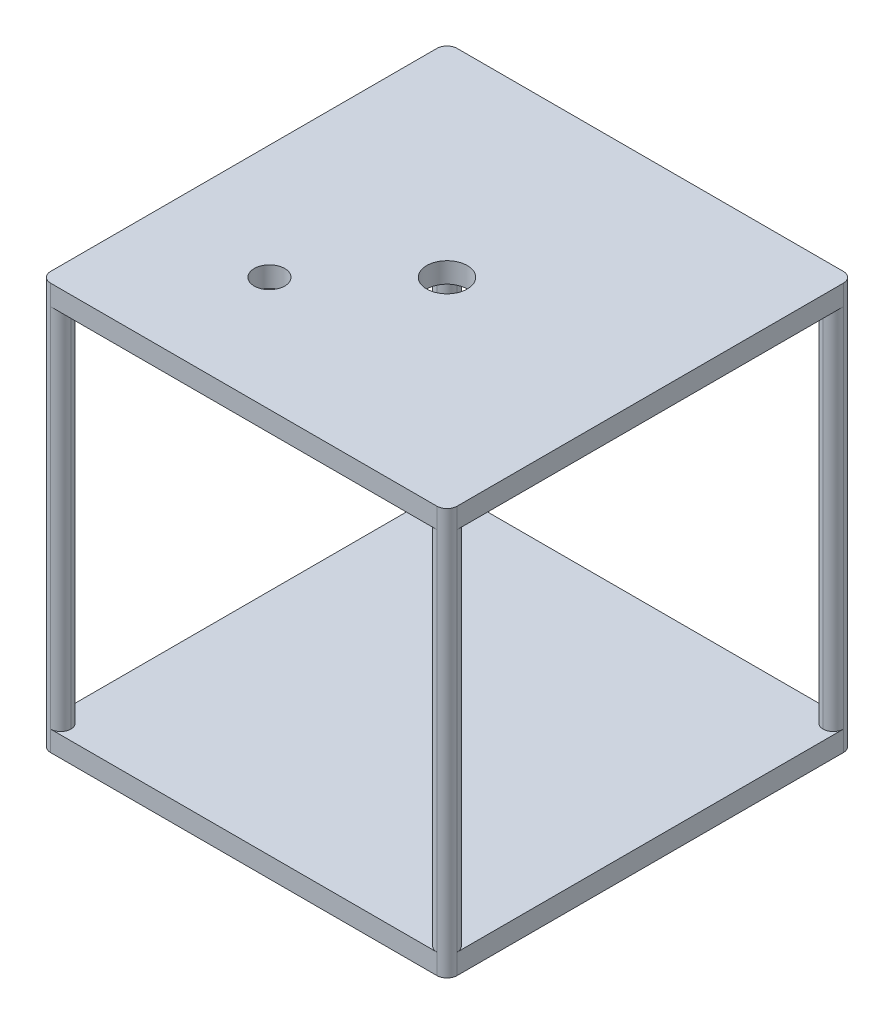
ISO-10303-21;
HEADER;
FILE_DESCRIPTION(('STEP AP214'),'2;1');
FILE_NAME('part.step','',(''),(''),'','','');
FILE_SCHEMA(('AUTOMOTIVE_DESIGN { 1 0 10303 214 1 1 1 1 }'));
ENDSEC;
DATA;
#1=APPLICATION_CONTEXT('core data for automotive mechanical design processes');
#2=APPLICATION_PROTOCOL_DEFINITION('international standard','automotive_design',2000,#1);
#3=PRODUCT_CONTEXT('',#1,'mechanical');
#4=PRODUCT('Part','Part','',(#3));
#5=PRODUCT_RELATED_PRODUCT_CATEGORY('part','',(#4));
#6=PRODUCT_DEFINITION_FORMATION('','',#4);
#7=PRODUCT_DEFINITION_CONTEXT('part definition',#1,'design');
#8=PRODUCT_DEFINITION('design','',#6,#7);
#9=PRODUCT_DEFINITION_SHAPE('','',#8);
#10=(LENGTH_UNIT() NAMED_UNIT(*) SI_UNIT(.MILLI.,.METRE.));
#11=(NAMED_UNIT(*) PLANE_ANGLE_UNIT() SI_UNIT($,.RADIAN.));
#12=(NAMED_UNIT(*) SI_UNIT($,.STERADIAN.) SOLID_ANGLE_UNIT());
#13=UNCERTAINTY_MEASURE_WITH_UNIT(LENGTH_MEASURE(1.E-05),#10,'distance_accuracy_value','');
#14=(GEOMETRIC_REPRESENTATION_CONTEXT(3) GLOBAL_UNCERTAINTY_ASSIGNED_CONTEXT((#13)) GLOBAL_UNIT_ASSIGNED_CONTEXT((#10,
#11,#12)) REPRESENTATION_CONTEXT('',''));
#15=CARTESIAN_POINT('',(0.,0.,0.));
#16=DIRECTION('',(0.,0.,1.));
#17=DIRECTION('',(1.,0.,0.));
#18=AXIS2_PLACEMENT_3D('',#15,#16,#17);
#19=CARTESIAN_POINT('',(200.,400.,200.));
#20=DIRECTION('',(0.,0.,-1.));
#21=DIRECTION('',(-1.,0.,0.));
#22=AXIS2_PLACEMENT_3D('',#19,#20,#21);
#23=PLANE('',#22);
#24=DIRECTION('',(0.,-1.,0.));
#25=VECTOR('',#24,1.);
#26=CARTESIAN_POINT('',(-190.,400.,200.));
#27=LINE('',#26,#25);
#28=CARTESIAN_POINT('',(-190.,400.,200.));
#29=VERTEX_POINT('',#28);
#30=CARTESIAN_POINT('',(-190.,380.,200.));
#31=VERTEX_POINT('',#30);
#32=EDGE_CURVE('E401',#29,#31,#27,.T.);
#33=ORIENTED_EDGE('',*,*,#32,.T.);
#34=DIRECTION('',(-1.,0.,0.));
#35=VECTOR('',#34,1.);
#36=CARTESIAN_POINT('',(180.,380.,200.));
#37=LINE('',#36,#35);
#38=CARTESIAN_POINT('',(190.,380.,200.));
#39=VERTEX_POINT('',#38);
#40=EDGE_CURVE('E473',#39,#31,#37,.T.);
#41=ORIENTED_EDGE('',*,*,#40,.F.);
#42=DIRECTION('',(0.,-1.,0.));
#43=VECTOR('',#42,1.);
#44=CARTESIAN_POINT('',(190.,400.,200.));
#45=LINE('',#44,#43);
#46=CARTESIAN_POINT('',(190.,400.,200.));
#47=VERTEX_POINT('',#46);
#48=EDGE_CURVE('E252',#39,#47,#45,.F.);
#49=ORIENTED_EDGE('',*,*,#48,.T.);
#50=DIRECTION('',(1.,0.,0.));
#51=VECTOR('',#50,1.);
#52=CARTESIAN_POINT('',(200.,400.,200.));
#53=LINE('',#52,#51);
#54=EDGE_CURVE('E463',#29,#47,#53,.T.);
#55=ORIENTED_EDGE('',*,*,#54,.F.);
#56=EDGE_LOOP('',(#33,#41,#49,#55));
#57=FACE_BOUND('',#56,.T.);
#58=ADVANCED_FACE('F39',(#57),#23,.F.);
#59=CARTESIAN_POINT('',(-200.,400.,-200.));
#60=DIRECTION('',(1.,0.,0.));
#61=DIRECTION('',(0.,0.,-1.));
#62=AXIS2_PLACEMENT_3D('',#59,#60,#61);
#63=PLANE('',#62);
#64=DIRECTION('',(0.,-1.,0.));
#65=VECTOR('',#64,1.);
#66=CARTESIAN_POINT('',(-200.,400.,190.));
#67=LINE('',#66,#65);
#68=CARTESIAN_POINT('',(-200.,0.,190.));
#69=VERTEX_POINT('',#68);
#70=CARTESIAN_POINT('',(-200.,20.,190.));
#71=VERTEX_POINT('',#70);
#72=EDGE_CURVE('E394',#69,#71,#67,.F.);
#73=ORIENTED_EDGE('',*,*,#72,.T.);
#74=DIRECTION('',(0.,0.,1.));
#75=VECTOR('',#74,1.);
#76=CARTESIAN_POINT('',(-200.,20.,180.));
#77=LINE('',#76,#75);
#78=CARTESIAN_POINT('',(-200.,19.9999999999999,-190.));
#79=VERTEX_POINT('',#78);
#80=EDGE_CURVE('E338',#79,#71,#77,.T.);
#81=ORIENTED_EDGE('',*,*,#80,.F.);
#82=DIRECTION('',(0.,-1.,0.));
#83=VECTOR('',#82,1.);
#84=CARTESIAN_POINT('',(-200.,400.,-190.));
#85=LINE('',#84,#83);
#86=CARTESIAN_POINT('',(-200.,0.,-190.));
#87=VERTEX_POINT('',#86);
#88=EDGE_CURVE('E290',#79,#87,#85,.T.);
#89=ORIENTED_EDGE('',*,*,#88,.T.);
#90=DIRECTION('',(0.,0.,1.));
#91=VECTOR('',#90,1.);
#92=CARTESIAN_POINT('',(-200.,0.,-200.));
#93=LINE('',#92,#91);
#94=EDGE_CURVE('E481',#87,#69,#93,.T.);
#95=ORIENTED_EDGE('',*,*,#94,.T.);
#96=EDGE_LOOP('',(#73,#81,#89,#95));
#97=FACE_BOUND('',#96,.T.);
#98=ADVANCED_FACE('F555',(#97),#63,.F.);
#99=CARTESIAN_POINT('',(200.,400.,-200.));
#100=DIRECTION('',(0.,0.,1.));
#101=DIRECTION('',(1.,0.,0.));
#102=AXIS2_PLACEMENT_3D('',#99,#100,#101);
#103=PLANE('',#102);
#104=DIRECTION('',(0.,-1.,0.));
#105=VECTOR('',#104,1.);
#106=CARTESIAN_POINT('',(190.,400.,-200.));
#107=LINE('',#106,#105);
#108=CARTESIAN_POINT('',(190.,400.,-200.));
#109=VERTEX_POINT('',#108);
#110=CARTESIAN_POINT('',(190.,380.,-200.));
#111=VERTEX_POINT('',#110);
#112=EDGE_CURVE('E346',#109,#111,#107,.T.);
#113=ORIENTED_EDGE('',*,*,#112,.T.);
#114=DIRECTION('',(-1.,0.,0.));
#115=VECTOR('',#114,1.);
#116=CARTESIAN_POINT('',(180.,380.,-200.));
#117=LINE('',#116,#115);
#118=CARTESIAN_POINT('',(-190.,380.,-200.));
#119=VERTEX_POINT('',#118);
#120=EDGE_CURVE('E486',#111,#119,#117,.T.);
#121=ORIENTED_EDGE('',*,*,#120,.T.);
#122=DIRECTION('',(0.,-1.,0.));
#123=VECTOR('',#122,1.);
#124=CARTESIAN_POINT('',(-190.,400.,-200.));
#125=LINE('',#124,#123);
#126=CARTESIAN_POINT('',(-190.,400.,-200.));
#127=VERTEX_POINT('',#126);
#128=EDGE_CURVE('E278',#119,#127,#125,.F.);
#129=ORIENTED_EDGE('',*,*,#128,.T.);
#130=DIRECTION('',(-1.,0.,0.));
#131=VECTOR('',#130,1.);
#132=CARTESIAN_POINT('',(200.,400.,-200.));
#133=LINE('',#132,#131);
#134=EDGE_CURVE('E235',#109,#127,#133,.T.);
#135=ORIENTED_EDGE('',*,*,#134,.F.);
#136=EDGE_LOOP('',(#113,#121,#129,#135));
#137=FACE_BOUND('',#136,.T.);
#138=ADVANCED_FACE('F561',(#137),#103,.F.);
#139=CARTESIAN_POINT('',(200.,400.,-200.));
#140=DIRECTION('',(-1.,0.,0.));
#141=DIRECTION('',(0.,0.,1.));
#142=AXIS2_PLACEMENT_3D('',#139,#140,#141);
#143=PLANE('',#142);
#144=DIRECTION('',(0.,-1.,0.));
#145=VECTOR('',#144,1.);
#146=CARTESIAN_POINT('',(200.,400.,-190.));
#147=LINE('',#146,#145);
#148=CARTESIAN_POINT('',(200.,0.,-190.));
#149=VERTEX_POINT('',#148);
#150=CARTESIAN_POINT('',(200.,20.,-190.));
#151=VERTEX_POINT('',#150);
#152=EDGE_CURVE('E207',#149,#151,#147,.F.);
#153=ORIENTED_EDGE('',*,*,#152,.T.);
#154=DIRECTION('',(0.,0.,1.));
#155=VECTOR('',#154,1.);
#156=CARTESIAN_POINT('',(200.,20.,180.));
#157=LINE('',#156,#155);
#158=CARTESIAN_POINT('',(200.,20.,190.));
#159=VERTEX_POINT('',#158);
#160=EDGE_CURVE('E199',#151,#159,#157,.T.);
#161=ORIENTED_EDGE('',*,*,#160,.T.);
#162=DIRECTION('',(0.,-1.,0.));
#163=VECTOR('',#162,1.);
#164=CARTESIAN_POINT('',(200.,400.,190.));
#165=LINE('',#164,#163);
#166=CARTESIAN_POINT('',(200.,0.,190.));
#167=VERTEX_POINT('',#166);
#168=EDGE_CURVE('E204',#159,#167,#165,.T.);
#169=ORIENTED_EDGE('',*,*,#168,.T.);
#170=DIRECTION('',(0.,0.,-1.));
#171=VECTOR('',#170,1.);
#172=CARTESIAN_POINT('',(200.,0.,-200.));
#173=LINE('',#172,#171);
#174=EDGE_CURVE('E470',#167,#149,#173,.T.);
#175=ORIENTED_EDGE('',*,*,#174,.T.);
#176=EDGE_LOOP('',(#153,#161,#169,#175));
#177=FACE_BOUND('',#176,.T.);
#178=ADVANCED_FACE('F201',(#177),#143,.F.);
#179=DIRECTION('',(0.,0.,-1.));
#180=VECTOR('',#179,1.);
#181=CARTESIAN_POINT('',(-200.,380.,180.));
#182=LINE('',#181,#180);
#183=CARTESIAN_POINT('',(-200.,380.,190.));
#184=VERTEX_POINT('',#183);
#185=CARTESIAN_POINT('',(-200.,380.,-190.));
#186=VERTEX_POINT('',#185);
#187=EDGE_CURVE('E213',#184,#186,#182,.T.);
#188=ORIENTED_EDGE('',*,*,#187,.F.);
#189=DIRECTION('',(0.,-1.,0.));
#190=VECTOR('',#189,1.);
#191=CARTESIAN_POINT('',(-200.,400.,190.));
#192=LINE('',#191,#190);
#193=CARTESIAN_POINT('',(-200.,400.,190.));
#194=VERTEX_POINT('',#193);
#195=EDGE_CURVE('E376',#184,#194,#192,.F.);
#196=ORIENTED_EDGE('',*,*,#195,.T.);
#197=DIRECTION('',(0.,0.,1.));
#198=VECTOR('',#197,1.);
#199=CARTESIAN_POINT('',(-200.,400.,-200.));
#200=LINE('',#199,#198);
#201=CARTESIAN_POINT('',(-200.,400.,-190.));
#202=VERTEX_POINT('',#201);
#203=EDGE_CURVE('E456',#202,#194,#200,.T.);
#204=ORIENTED_EDGE('',*,*,#203,.F.);
#205=DIRECTION('',(0.,-1.,0.));
#206=VECTOR('',#205,1.);
#207=CARTESIAN_POINT('',(-200.,400.,-190.));
#208=LINE('',#207,#206);
#209=EDGE_CURVE('E286',#202,#186,#208,.T.);
#210=ORIENTED_EDGE('',*,*,#209,.T.);
#211=EDGE_LOOP('',(#188,#196,#204,#210));
#212=FACE_BOUND('',#211,.T.);
#213=ADVANCED_FACE('F455',(#212),#63,.F.);
#214=DIRECTION('',(1.,0.,0.));
#215=VECTOR('',#214,1.);
#216=CARTESIAN_POINT('',(180.,20.,200.));
#217=LINE('',#216,#215);
#218=CARTESIAN_POINT('',(-190.,20.,200.));
#219=VERTEX_POINT('',#218);
#220=CARTESIAN_POINT('',(190.,20.,200.));
#221=VERTEX_POINT('',#220);
#222=EDGE_CURVE('E513',#219,#221,#217,.T.);
#223=ORIENTED_EDGE('',*,*,#222,.F.);
#224=DIRECTION('',(0.,-1.,0.));
#225=VECTOR('',#224,1.);
#226=CARTESIAN_POINT('',(-190.,400.,200.));
#227=LINE('',#226,#225);
#228=CARTESIAN_POINT('',(-190.,0.,200.));
#229=VERTEX_POINT('',#228);
#230=EDGE_CURVE('E398',#219,#229,#227,.T.);
#231=ORIENTED_EDGE('',*,*,#230,.T.);
#232=DIRECTION('',(1.,0.,0.));
#233=VECTOR('',#232,1.);
#234=CARTESIAN_POINT('',(200.,0.,200.));
#235=LINE('',#234,#233);
#236=CARTESIAN_POINT('',(190.,0.,200.));
#237=VERTEX_POINT('',#236);
#238=EDGE_CURVE('E485',#229,#237,#235,.T.);
#239=ORIENTED_EDGE('',*,*,#238,.T.);
#240=EDGE_CURVE('E253',#237,#221,#45,.F.);
#241=ORIENTED_EDGE('',*,*,#240,.T.);
#242=EDGE_LOOP('',(#223,#231,#239,#241));
#243=FACE_BOUND('',#242,.T.);
#244=ADVANCED_FACE('F557',(#243),#23,.F.);
#245=DIRECTION('',(0.,0.,-1.));
#246=VECTOR('',#245,1.);
#247=CARTESIAN_POINT('',(200.,380.,180.));
#248=LINE('',#247,#246);
#249=CARTESIAN_POINT('',(200.,380.,190.));
#250=VERTEX_POINT('',#249);
#251=CARTESIAN_POINT('',(200.,380.,-190.));
#252=VERTEX_POINT('',#251);
#253=EDGE_CURVE('E212',#250,#252,#248,.T.);
#254=ORIENTED_EDGE('',*,*,#253,.T.);
#255=DIRECTION('',(0.,-1.,0.));
#256=VECTOR('',#255,1.);
#257=CARTESIAN_POINT('',(200.,400.,-190.));
#258=LINE('',#257,#256);
#259=CARTESIAN_POINT('',(200.,400.,-190.));
#260=VERTEX_POINT('',#259);
#261=EDGE_CURVE('E322',#252,#260,#258,.F.);
#262=ORIENTED_EDGE('',*,*,#261,.T.);
#263=DIRECTION('',(0.,0.,-1.));
#264=VECTOR('',#263,1.);
#265=CARTESIAN_POINT('',(200.,400.,-200.));
#266=LINE('',#265,#264);
#267=CARTESIAN_POINT('',(200.,400.,190.));
#268=VERTEX_POINT('',#267);
#269=EDGE_CURVE('E468',#268,#260,#266,.T.);
#270=ORIENTED_EDGE('',*,*,#269,.F.);
#271=DIRECTION('',(0.,-1.,0.));
#272=VECTOR('',#271,1.);
#273=CARTESIAN_POINT('',(200.,400.,190.));
#274=LINE('',#273,#272);
#275=EDGE_CURVE('E244',#268,#250,#274,.T.);
#276=ORIENTED_EDGE('',*,*,#275,.T.);
#277=EDGE_LOOP('',(#254,#262,#270,#276));
#278=FACE_BOUND('',#277,.T.);
#279=ADVANCED_FACE('F566',(#278),#143,.F.);
#280=DIRECTION('',(1.,0.,0.));
#281=VECTOR('',#280,1.);
#282=CARTESIAN_POINT('',(180.,20.,-200.));
#283=LINE('',#282,#281);
#284=CARTESIAN_POINT('',(-190.,20.,-200.));
#285=VERTEX_POINT('',#284);
#286=CARTESIAN_POINT('',(190.,20.,-200.));
#287=VERTEX_POINT('',#286);
#288=EDGE_CURVE('E512',#285,#287,#283,.T.);
#289=ORIENTED_EDGE('',*,*,#288,.T.);
#290=DIRECTION('',(0.,-1.,0.));
#291=VECTOR('',#290,1.);
#292=CARTESIAN_POINT('',(190.,400.,-200.));
#293=LINE('',#292,#291);
#294=CARTESIAN_POINT('',(190.,0.,-200.));
#295=VERTEX_POINT('',#294);
#296=EDGE_CURVE('E343',#287,#295,#293,.T.);
#297=ORIENTED_EDGE('',*,*,#296,.T.);
#298=DIRECTION('',(-1.,0.,0.));
#299=VECTOR('',#298,1.);
#300=CARTESIAN_POINT('',(200.,0.,-200.));
#301=LINE('',#300,#299);
#302=CARTESIAN_POINT('',(-190.,0.,-200.));
#303=VERTEX_POINT('',#302);
#304=EDGE_CURVE('E464',#295,#303,#301,.T.);
#305=ORIENTED_EDGE('',*,*,#304,.T.);
#306=DIRECTION('',(0.,-1.,0.));
#307=VECTOR('',#306,1.);
#308=CARTESIAN_POINT('',(-190.,400.,-200.));
#309=LINE('',#308,#307);
#310=EDGE_CURVE('E282',#303,#285,#309,.F.);
#311=ORIENTED_EDGE('',*,*,#310,.T.);
#312=EDGE_LOOP('',(#289,#297,#305,#311));
#313=FACE_BOUND('',#312,.T.);
#314=ADVANCED_FACE('F572',(#313),#103,.F.);
#315=CARTESIAN_POINT('',(0.,400.,0.));
#316=DIRECTION('',(0.,-1.,0.));
#317=DIRECTION('',(0.,0.,-1.));
#318=AXIS2_PLACEMENT_3D('',#315,#316,#317);
#319=PLANE('',#318);
#320=CARTESIAN_POINT('',(-87.3276874765386,400.,87.3276874765386));
#321=DIRECTION('',(0.,1.,0.));
#322=DIRECTION('',(0.,0.,1.));
#323=AXIS2_PLACEMENT_3D('',#320,#321,#322);
#324=CIRCLE('',#323,15.);
#325=CARTESIAN_POINT('',(-87.3276874765386,400.,102.327687476539));
#326=VERTEX_POINT('',#325);
#327=EDGE_CURVE('E533',#326,#326,#324,.T.);
#328=ORIENTED_EDGE('',*,*,#327,.F.);
#329=EDGE_LOOP('',(#328));
#330=FACE_BOUND('',#329,.T.);
#331=CARTESIAN_POINT('',(0.,400.,0.));
#332=DIRECTION('',(0.,1.,0.));
#333=DIRECTION('',(0.,0.,1.));
#334=AXIS2_PLACEMENT_3D('',#331,#332,#333);
#335=CIRCLE('',#334,20.);
#336=CARTESIAN_POINT('',(0.,400.,20.));
#337=VERTEX_POINT('',#336);
#338=EDGE_CURVE('E526',#337,#337,#335,.T.);
#339=ORIENTED_EDGE('',*,*,#338,.F.);
#340=EDGE_LOOP('',(#339));
#341=FACE_BOUND('',#340,.T.);
#342=ORIENTED_EDGE('',*,*,#203,.T.);
#343=CARTESIAN_POINT('',(-190.,400.,190.));
#344=DIRECTION('',(0.,-1.,0.));
#345=DIRECTION('',(0.,0.,-1.));
#346=AXIS2_PLACEMENT_3D('',#343,#344,#345);
#347=CIRCLE('',#346,10.);
#348=EDGE_CURVE('E408',#194,#29,#347,.F.);
#349=ORIENTED_EDGE('',*,*,#348,.T.);
#350=ORIENTED_EDGE('',*,*,#54,.T.);
#351=CARTESIAN_POINT('',(190.,400.,190.));
#352=DIRECTION('',(0.,-1.,0.));
#353=DIRECTION('',(0.,0.,-1.));
#354=AXIS2_PLACEMENT_3D('',#351,#352,#353);
#355=CIRCLE('',#354,10.);
#356=EDGE_CURVE('E257',#47,#268,#355,.F.);
#357=ORIENTED_EDGE('',*,*,#356,.T.);
#358=ORIENTED_EDGE('',*,*,#269,.T.);
#359=CARTESIAN_POINT('',(190.,400.,-190.));
#360=DIRECTION('',(0.,-1.,0.));
#361=DIRECTION('',(0.,0.,-1.));
#362=AXIS2_PLACEMENT_3D('',#359,#360,#361);
#363=CIRCLE('',#362,10.);
#364=EDGE_CURVE('E353',#260,#109,#363,.F.);
#365=ORIENTED_EDGE('',*,*,#364,.T.);
#366=ORIENTED_EDGE('',*,*,#134,.T.);
#367=CARTESIAN_POINT('',(-190.,400.,-190.));
#368=DIRECTION('',(0.,-1.,0.));
#369=DIRECTION('',(0.,0.,-1.));
#370=AXIS2_PLACEMENT_3D('',#367,#368,#369);
#371=CIRCLE('',#370,10.);
#372=EDGE_CURVE('E297',#127,#202,#371,.F.);
#373=ORIENTED_EDGE('',*,*,#372,.T.);
#374=EDGE_LOOP('',(#342,#349,#350,#357,#358,#365,#366,#373));
#375=FACE_BOUND('',#374,.T.);
#376=ADVANCED_FACE('F459',(#330,#341,#375),#319,.F.);
#377=CARTESIAN_POINT('',(0.,0.,0.));
#378=DIRECTION('',(0.,-1.,0.));
#379=DIRECTION('',(0.,0.,-1.));
#380=AXIS2_PLACEMENT_3D('',#377,#378,#379);
#381=PLANE('',#380);
#382=ORIENTED_EDGE('',*,*,#238,.F.);
#383=CARTESIAN_POINT('',(-190.,0.,190.));
#384=DIRECTION('',(0.,-1.,0.));
#385=DIRECTION('',(0.,0.,-1.));
#386=AXIS2_PLACEMENT_3D('',#383,#384,#385);
#387=CIRCLE('',#386,10.);
#388=EDGE_CURVE('E405',#229,#69,#387,.T.);
#389=ORIENTED_EDGE('',*,*,#388,.T.);
#390=ORIENTED_EDGE('',*,*,#94,.F.);
#391=CARTESIAN_POINT('',(-190.,0.,-190.));
#392=DIRECTION('',(0.,-1.,0.));
#393=DIRECTION('',(0.,0.,-1.));
#394=AXIS2_PLACEMENT_3D('',#391,#392,#393);
#395=CIRCLE('',#394,10.);
#396=EDGE_CURVE('E293',#87,#303,#395,.T.);
#397=ORIENTED_EDGE('',*,*,#396,.T.);
#398=ORIENTED_EDGE('',*,*,#304,.F.);
#399=CARTESIAN_POINT('',(190.,0.,-190.));
#400=DIRECTION('',(0.,-1.,0.));
#401=DIRECTION('',(0.,0.,-1.));
#402=AXIS2_PLACEMENT_3D('',#399,#400,#401);
#403=CIRCLE('',#402,10.);
#404=EDGE_CURVE('E350',#295,#149,#403,.T.);
#405=ORIENTED_EDGE('',*,*,#404,.T.);
#406=ORIENTED_EDGE('',*,*,#174,.F.);
#407=CARTESIAN_POINT('',(190.,0.,190.));
#408=DIRECTION('',(0.,-1.,0.));
#409=DIRECTION('',(0.,0.,-1.));
#410=AXIS2_PLACEMENT_3D('',#407,#408,#409);
#411=CIRCLE('',#410,10.);
#412=EDGE_CURVE('E242',#167,#237,#411,.T.);
#413=ORIENTED_EDGE('',*,*,#412,.T.);
#414=EDGE_LOOP('',(#382,#389,#390,#397,#398,#405,#406,#413));
#415=FACE_BOUND('',#414,.T.);
#416=ADVANCED_FACE('F636',(#415),#381,.T.);
#417=CARTESIAN_POINT('',(180.,380.,-200.));
#418=DIRECTION('',(0.,1.,0.));
#419=DIRECTION('',(0.,0.,1.));
#420=AXIS2_PLACEMENT_3D('',#417,#418,#419);
#421=PLANE('',#420);
#422=CARTESIAN_POINT('',(-87.3276874765386,380.,87.3276874765386));
#423=DIRECTION('',(0.,1.,0.));
#424=DIRECTION('',(0.,0.,1.));
#425=AXIS2_PLACEMENT_3D('',#422,#423,#424);
#426=CIRCLE('',#425,15.);
#427=CARTESIAN_POINT('',(-87.3276874765386,380.,102.327687476539));
#428=VERTEX_POINT('',#427);
#429=EDGE_CURVE('E43',#428,#428,#426,.T.);
#430=ORIENTED_EDGE('',*,*,#429,.T.);
#431=EDGE_LOOP('',(#430));
#432=FACE_BOUND('',#431,.T.);
#433=CARTESIAN_POINT('',(0.,380.,0.));
#434=DIRECTION('',(0.,1.,0.));
#435=DIRECTION('',(0.,0.,1.));
#436=AXIS2_PLACEMENT_3D('',#433,#434,#435);
#437=CIRCLE('',#436,20.);
#438=CARTESIAN_POINT('',(0.,380.,20.));
#439=VERTEX_POINT('',#438);
#440=EDGE_CURVE('E432',#439,#439,#437,.T.);
#441=ORIENTED_EDGE('',*,*,#440,.T.);
#442=EDGE_LOOP('',(#441));
#443=FACE_BOUND('',#442,.T.);
#444=ORIENTED_EDGE('',*,*,#40,.T.);
#445=CARTESIAN_POINT('',(-190.,380.,190.));
#446=DIRECTION('',(0.,1.,0.));
#447=DIRECTION('',(0.,0.,1.));
#448=AXIS2_PLACEMENT_3D('',#445,#446,#447);
#449=CIRCLE('',#448,10.);
#450=CARTESIAN_POINT('',(-180.,380.,190.));
#451=VERTEX_POINT('',#450);
#452=EDGE_CURVE('E11',#31,#451,#449,.T.);
#453=ORIENTED_EDGE('',*,*,#452,.T.);
#454=CARTESIAN_POINT('',(-190.,380.,190.));
#455=DIRECTION('',(0.,1.,0.));
#456=DIRECTION('',(0.,0.,1.));
#457=AXIS2_PLACEMENT_3D('',#454,#455,#456);
#458=CIRCLE('',#457,10.);
#459=CARTESIAN_POINT('',(-190.,380.,180.));
#460=VERTEX_POINT('',#459);
#461=EDGE_CURVE('E411',#451,#460,#458,.T.);
#462=ORIENTED_EDGE('',*,*,#461,.T.);
#463=CARTESIAN_POINT('',(-190.,380.,190.));
#464=DIRECTION('',(0.,1.,0.));
#465=DIRECTION('',(0.,0.,1.));
#466=AXIS2_PLACEMENT_3D('',#463,#464,#465);
#467=CIRCLE('',#466,10.);
#468=EDGE_CURVE('E419',#460,#184,#467,.T.);
#469=ORIENTED_EDGE('',*,*,#468,.T.);
#470=ORIENTED_EDGE('',*,*,#187,.T.);
#471=CARTESIAN_POINT('',(-190.,380.,-190.));
#472=DIRECTION('',(0.,1.,0.));
#473=DIRECTION('',(0.,0.,1.));
#474=AXIS2_PLACEMENT_3D('',#471,#472,#473);
#475=CIRCLE('',#474,10.);
#476=CARTESIAN_POINT('',(-190.,380.,-180.));
#477=VERTEX_POINT('',#476);
#478=EDGE_CURVE('E319',#186,#477,#475,.T.);
#479=ORIENTED_EDGE('',*,*,#478,.T.);
#480=CARTESIAN_POINT('',(-190.,380.,-190.));
#481=DIRECTION('',(0.,1.,0.));
#482=DIRECTION('',(0.,0.,1.));
#483=AXIS2_PLACEMENT_3D('',#480,#481,#482);
#484=CIRCLE('',#483,10.);
#485=CARTESIAN_POINT('',(-180.,380.,-190.));
#486=VERTEX_POINT('',#485);
#487=EDGE_CURVE('E304',#477,#486,#484,.T.);
#488=ORIENTED_EDGE('',*,*,#487,.T.);
#489=CARTESIAN_POINT('',(-190.,380.,-190.));
#490=DIRECTION('',(0.,1.,0.));
#491=DIRECTION('',(0.,0.,1.));
#492=AXIS2_PLACEMENT_3D('',#489,#490,#491);
#493=CIRCLE('',#492,10.);
#494=EDGE_CURVE('E311',#486,#119,#493,.T.);
#495=ORIENTED_EDGE('',*,*,#494,.T.);
#496=ORIENTED_EDGE('',*,*,#120,.F.);
#497=CARTESIAN_POINT('',(190.,380.,-190.));
#498=DIRECTION('',(0.,1.,0.));
#499=DIRECTION('',(0.,0.,1.));
#500=AXIS2_PLACEMENT_3D('',#497,#498,#499);
#501=CIRCLE('',#500,10.);
#502=CARTESIAN_POINT('',(180.,380.,-190.));
#503=VERTEX_POINT('',#502);
#504=EDGE_CURVE('E369',#111,#503,#501,.T.);
#505=ORIENTED_EDGE('',*,*,#504,.T.);
#506=CARTESIAN_POINT('',(190.,380.,-190.));
#507=DIRECTION('',(0.,1.,0.));
#508=DIRECTION('',(0.,0.,1.));
#509=AXIS2_PLACEMENT_3D('',#506,#507,#508);
#510=CIRCLE('',#509,10.);
#511=CARTESIAN_POINT('',(190.,380.,-180.));
#512=VERTEX_POINT('',#511);
#513=EDGE_CURVE('E363',#503,#512,#510,.T.);
#514=ORIENTED_EDGE('',*,*,#513,.T.);
#515=CARTESIAN_POINT('',(190.,380.,-190.));
#516=DIRECTION('',(0.,1.,0.));
#517=DIRECTION('',(0.,0.,1.));
#518=AXIS2_PLACEMENT_3D('',#515,#516,#517);
#519=CIRCLE('',#518,10.);
#520=EDGE_CURVE('E359',#512,#252,#519,.T.);
#521=ORIENTED_EDGE('',*,*,#520,.T.);
#522=ORIENTED_EDGE('',*,*,#253,.F.);
#523=CARTESIAN_POINT('',(190.,380.,190.));
#524=DIRECTION('',(0.,1.,0.));
#525=DIRECTION('',(0.,0.,1.));
#526=AXIS2_PLACEMENT_3D('',#523,#524,#525);
#527=CIRCLE('',#526,10.);
#528=CARTESIAN_POINT('',(190.,380.,180.));
#529=VERTEX_POINT('',#528);
#530=EDGE_CURVE('E225',#250,#529,#527,.T.);
#531=ORIENTED_EDGE('',*,*,#530,.T.);
#532=CARTESIAN_POINT('',(190.,380.,190.));
#533=DIRECTION('',(0.,1.,0.));
#534=DIRECTION('',(0.,0.,1.));
#535=AXIS2_PLACEMENT_3D('',#532,#533,#534);
#536=CIRCLE('',#535,10.);
#537=CARTESIAN_POINT('',(180.,380.,190.));
#538=VERTEX_POINT('',#537);
#539=EDGE_CURVE('E267',#529,#538,#536,.T.);
#540=ORIENTED_EDGE('',*,*,#539,.T.);
#541=CARTESIAN_POINT('',(190.,380.,190.));
#542=DIRECTION('',(0.,1.,0.));
#543=DIRECTION('',(0.,0.,1.));
#544=AXIS2_PLACEMENT_3D('',#541,#542,#543);
#545=CIRCLE('',#544,10.);
#546=EDGE_CURVE('E271',#538,#39,#545,.T.);
#547=ORIENTED_EDGE('',*,*,#546,.T.);
#548=EDGE_LOOP('',(#444,#453,#462,#469,#470,#479,#488,#495,#496,#505,#514,#521,#522,#531,#540,#547));
#549=FACE_BOUND('',#548,.T.);
#550=ADVANCED_FACE('F495',(#432,#443,#549),#421,.F.);
#551=CARTESIAN_POINT('',(180.,20.,-200.));
#552=DIRECTION('',(0.,-1.,0.));
#553=DIRECTION('',(1.,0.,0.));
#554=AXIS2_PLACEMENT_3D('',#551,#552,#553);
#555=PLANE('',#554);
#556=ORIENTED_EDGE('',*,*,#222,.T.);
#557=CARTESIAN_POINT('',(190.,20.,190.));
#558=DIRECTION('',(0.,-1.,0.));
#559=DIRECTION('',(1.,0.,0.));
#560=AXIS2_PLACEMENT_3D('',#557,#558,#559);
#561=CIRCLE('',#560,10.);
#562=CARTESIAN_POINT('',(180.,20.,190.));
#563=VERTEX_POINT('',#562);
#564=EDGE_CURVE('E275',#221,#563,#561,.T.);
#565=ORIENTED_EDGE('',*,*,#564,.T.);
#566=CARTESIAN_POINT('',(190.,20.,190.));
#567=DIRECTION('',(0.,-1.,0.));
#568=DIRECTION('',(1.,0.,0.));
#569=AXIS2_PLACEMENT_3D('',#566,#567,#568);
#570=CIRCLE('',#569,10.);
#571=CARTESIAN_POINT('',(190.,20.,180.));
#572=VERTEX_POINT('',#571);
#573=EDGE_CURVE('E220',#563,#572,#570,.T.);
#574=ORIENTED_EDGE('',*,*,#573,.T.);
#575=CARTESIAN_POINT('',(190.,20.,190.));
#576=DIRECTION('',(0.,-1.,0.));
#577=DIRECTION('',(1.,0.,0.));
#578=AXIS2_PLACEMENT_3D('',#575,#576,#577);
#579=CIRCLE('',#578,10.);
#580=EDGE_CURVE('E216',#572,#159,#579,.T.);
#581=ORIENTED_EDGE('',*,*,#580,.T.);
#582=ORIENTED_EDGE('',*,*,#160,.F.);
#583=CARTESIAN_POINT('',(190.,20.,-190.));
#584=DIRECTION('',(0.,-1.,0.));
#585=DIRECTION('',(1.,0.,0.));
#586=AXIS2_PLACEMENT_3D('',#583,#584,#585);
#587=CIRCLE('',#586,10.);
#588=CARTESIAN_POINT('',(190.,20.,-180.));
#589=VERTEX_POINT('',#588);
#590=EDGE_CURVE('E356',#151,#589,#587,.T.);
#591=ORIENTED_EDGE('',*,*,#590,.T.);
#592=CARTESIAN_POINT('',(190.,20.,-190.));
#593=DIRECTION('',(0.,-1.,0.));
#594=DIRECTION('',(1.,0.,0.));
#595=AXIS2_PLACEMENT_3D('',#592,#593,#594);
#596=CIRCLE('',#595,10.);
#597=CARTESIAN_POINT('',(180.,20.,-190.));
#598=VERTEX_POINT('',#597);
#599=EDGE_CURVE('E366',#589,#598,#596,.T.);
#600=ORIENTED_EDGE('',*,*,#599,.T.);
#601=CARTESIAN_POINT('',(190.,20.,-190.));
#602=DIRECTION('',(0.,-1.,0.));
#603=DIRECTION('',(1.,0.,0.));
#604=AXIS2_PLACEMENT_3D('',#601,#602,#603);
#605=CIRCLE('',#604,10.);
#606=EDGE_CURVE('E372',#598,#287,#605,.T.);
#607=ORIENTED_EDGE('',*,*,#606,.T.);
#608=ORIENTED_EDGE('',*,*,#288,.F.);
#609=CARTESIAN_POINT('',(-190.,20.,-190.));
#610=DIRECTION('',(0.,-1.,0.));
#611=DIRECTION('',(1.,0.,0.));
#612=AXIS2_PLACEMENT_3D('',#609,#610,#611);
#613=CIRCLE('',#612,10.);
#614=CARTESIAN_POINT('',(-180.,20.,-190.));
#615=VERTEX_POINT('',#614);
#616=EDGE_CURVE('E308',#285,#615,#613,.T.);
#617=ORIENTED_EDGE('',*,*,#616,.T.);
#618=CARTESIAN_POINT('',(-190.,20.,-190.));
#619=DIRECTION('',(0.,-1.,0.));
#620=DIRECTION('',(1.,0.,0.));
#621=AXIS2_PLACEMENT_3D('',#618,#619,#620);
#622=CIRCLE('',#621,10.);
#623=CARTESIAN_POINT('',(-190.,20.,-180.));
#624=VERTEX_POINT('',#623);
#625=EDGE_CURVE('E300',#615,#624,#622,.T.);
#626=ORIENTED_EDGE('',*,*,#625,.T.);
#627=CARTESIAN_POINT('',(-190.,20.,-190.));
#628=DIRECTION('',(0.,-1.,0.));
#629=DIRECTION('',(1.,0.,0.));
#630=AXIS2_PLACEMENT_3D('',#627,#628,#629);
#631=CIRCLE('',#630,10.);
#632=EDGE_CURVE('E315',#624,#79,#631,.T.);
#633=ORIENTED_EDGE('',*,*,#632,.T.);
#634=ORIENTED_EDGE('',*,*,#80,.T.);
#635=CARTESIAN_POINT('',(-190.,20.,190.));
#636=DIRECTION('',(0.,-1.,0.));
#637=DIRECTION('',(1.,0.,0.));
#638=AXIS2_PLACEMENT_3D('',#635,#636,#637);
#639=CIRCLE('',#638,10.);
#640=CARTESIAN_POINT('',(-190.,20.,180.));
#641=VERTEX_POINT('',#640);
#642=EDGE_CURVE('E423',#71,#641,#639,.T.);
#643=ORIENTED_EDGE('',*,*,#642,.T.);
#644=CARTESIAN_POINT('',(-190.,20.,190.));
#645=DIRECTION('',(0.,-1.,0.));
#646=DIRECTION('',(1.,0.,0.));
#647=AXIS2_PLACEMENT_3D('',#644,#645,#646);
#648=CIRCLE('',#647,10.);
#649=CARTESIAN_POINT('',(-180.,20.,190.));
#650=VERTEX_POINT('',#649);
#651=EDGE_CURVE('E415',#641,#650,#648,.T.);
#652=ORIENTED_EDGE('',*,*,#651,.T.);
#653=CARTESIAN_POINT('',(-190.,20.,190.));
#654=DIRECTION('',(0.,-1.,0.));
#655=DIRECTION('',(1.,0.,0.));
#656=AXIS2_PLACEMENT_3D('',#653,#654,#655);
#657=CIRCLE('',#656,10.);
#658=EDGE_CURVE('E50',#650,#219,#657,.T.);
#659=ORIENTED_EDGE('',*,*,#658,.T.);
#660=EDGE_LOOP('',(#556,#565,#574,#581,#582,#591,#600,#607,#608,#617,#626,#633,#634,#643,#652,#659));
#661=FACE_BOUND('',#660,.T.);
#662=ADVANCED_FACE('F218',(#661),#555,.F.);
#663=CARTESIAN_POINT('',(190.,400.,190.));
#664=DIRECTION('',(0.,1.,0.));
#665=DIRECTION('',(0.,0.,1.));
#666=AXIS2_PLACEMENT_3D('',#663,#664,#665);
#667=CYLINDRICAL_SURFACE('',#666,10.);
#668=ORIENTED_EDGE('',*,*,#580,.F.);
#669=DIRECTION('',(0.,1.,0.));
#670=VECTOR('',#669,1.);
#671=CARTESIAN_POINT('',(190.,380.,180.));
#672=LINE('',#671,#670);
#673=EDGE_CURVE('E234',#529,#572,#672,.F.);
#674=ORIENTED_EDGE('',*,*,#673,.F.);
#675=ORIENTED_EDGE('',*,*,#530,.F.);
#676=DIRECTION('',(0.,1.,0.));
#677=VECTOR('',#676,1.);
#678=CARTESIAN_POINT('',(200.,400.,190.));
#679=LINE('',#678,#677);
#680=EDGE_CURVE('E228',#159,#250,#679,.T.);
#681=ORIENTED_EDGE('',*,*,#680,.F.);
#682=EDGE_LOOP('',(#668,#674,#675,#681));
#683=FACE_BOUND('',#682,.T.);
#684=ADVANCED_FACE('F229',(#683),#667,.T.);
#685=CARTESIAN_POINT('',(190.,400.,190.));
#686=DIRECTION('',(0.,-1.,0.));
#687=DIRECTION('',(0.,0.,-1.));
#688=AXIS2_PLACEMENT_3D('',#685,#686,#687);
#689=CYLINDRICAL_SURFACE('',#688,10.);
#690=ORIENTED_EDGE('',*,*,#356,.F.);
#691=ORIENTED_EDGE('',*,*,#48,.F.);
#692=EDGE_CURVE('E258',#221,#39,#45,.F.);
#693=ORIENTED_EDGE('',*,*,#692,.F.);
#694=ORIENTED_EDGE('',*,*,#240,.F.);
#695=ORIENTED_EDGE('',*,*,#412,.F.);
#696=ORIENTED_EDGE('',*,*,#168,.F.);
#697=ORIENTED_EDGE('',*,*,#680,.T.);
#698=ORIENTED_EDGE('',*,*,#275,.F.);
#699=EDGE_LOOP('',(#690,#691,#693,#694,#695,#696,#697,#698));
#700=FACE_BOUND('',#699,.T.);
#701=ADVANCED_FACE('F239',(#700),#689,.T.);
#702=CARTESIAN_POINT('',(190.,380.,190.));
#703=DIRECTION('',(0.,-1.,0.));
#704=DIRECTION('',(1.,0.,0.));
#705=AXIS2_PLACEMENT_3D('',#702,#703,#704);
#706=CYLINDRICAL_SURFACE('',#705,10.);
#707=ORIENTED_EDGE('',*,*,#539,.F.);
#708=ORIENTED_EDGE('',*,*,#673,.T.);
#709=ORIENTED_EDGE('',*,*,#573,.F.);
#710=DIRECTION('',(0.,-1.,0.));
#711=VECTOR('',#710,1.);
#712=CARTESIAN_POINT('',(180.,380.,190.));
#713=LINE('',#712,#711);
#714=EDGE_CURVE('E261',#538,#563,#713,.T.);
#715=ORIENTED_EDGE('',*,*,#714,.F.);
#716=EDGE_LOOP('',(#707,#708,#709,#715));
#717=FACE_BOUND('',#716,.T.);
#718=ADVANCED_FACE('F499',(#717),#706,.T.);
#719=CARTESIAN_POINT('',(190.,380.,190.));
#720=DIRECTION('',(0.,1.,0.));
#721=DIRECTION('',(-1.,0.,0.));
#722=AXIS2_PLACEMENT_3D('',#719,#720,#721);
#723=CYLINDRICAL_SURFACE('',#722,10.);
#724=ORIENTED_EDGE('',*,*,#564,.F.);
#725=ORIENTED_EDGE('',*,*,#692,.T.);
#726=ORIENTED_EDGE('',*,*,#546,.F.);
#727=ORIENTED_EDGE('',*,*,#714,.T.);
#728=EDGE_LOOP('',(#724,#725,#726,#727));
#729=FACE_BOUND('',#728,.T.);
#730=ADVANCED_FACE('F502',(#729),#723,.T.);
#731=CARTESIAN_POINT('',(-190.,400.,-190.));
#732=DIRECTION('',(0.,-1.,0.));
#733=DIRECTION('',(0.,0.,-1.));
#734=AXIS2_PLACEMENT_3D('',#731,#732,#733);
#735=CYLINDRICAL_SURFACE('',#734,10.);
#736=ORIENTED_EDGE('',*,*,#396,.F.);
#737=ORIENTED_EDGE('',*,*,#88,.F.);
#738=DIRECTION('',(0.,-1.,0.));
#739=VECTOR('',#738,1.);
#740=CARTESIAN_POINT('',(-200.,400.,-190.));
#741=LINE('',#740,#739);
#742=EDGE_CURVE('E334',#186,#79,#741,.T.);
#743=ORIENTED_EDGE('',*,*,#742,.F.);
#744=ORIENTED_EDGE('',*,*,#209,.F.);
#745=ORIENTED_EDGE('',*,*,#372,.F.);
#746=ORIENTED_EDGE('',*,*,#128,.F.);
#747=DIRECTION('',(0.,-1.,0.));
#748=VECTOR('',#747,1.);
#749=CARTESIAN_POINT('',(-190.,400.,-200.));
#750=LINE('',#749,#748);
#751=EDGE_CURVE('E330',#285,#119,#750,.F.);
#752=ORIENTED_EDGE('',*,*,#751,.F.);
#753=ORIENTED_EDGE('',*,*,#310,.F.);
#754=EDGE_LOOP('',(#736,#737,#743,#744,#745,#746,#752,#753));
#755=FACE_BOUND('',#754,.T.);
#756=ADVANCED_FACE('F607',(#755),#735,.T.);
#757=CARTESIAN_POINT('',(-190.,380.,-190.));
#758=DIRECTION('',(0.,-1.,0.));
#759=DIRECTION('',(0.,0.,-1.));
#760=AXIS2_PLACEMENT_3D('',#757,#758,#759);
#761=CYLINDRICAL_SURFACE('',#760,10.);
#762=ORIENTED_EDGE('',*,*,#742,.T.);
#763=ORIENTED_EDGE('',*,*,#632,.F.);
#764=DIRECTION('',(0.,-1.,0.));
#765=VECTOR('',#764,1.);
#766=CARTESIAN_POINT('',(-190.,380.,-180.));
#767=LINE('',#766,#765);
#768=EDGE_CURVE('E326',#477,#624,#767,.T.);
#769=ORIENTED_EDGE('',*,*,#768,.F.);
#770=ORIENTED_EDGE('',*,*,#478,.F.);
#771=EDGE_LOOP('',(#762,#763,#769,#770));
#772=FACE_BOUND('',#771,.T.);
#773=ADVANCED_FACE('F654',(#772),#761,.T.);
#774=CARTESIAN_POINT('',(-190.,400.,-190.));
#775=DIRECTION('',(0.,-1.,0.));
#776=DIRECTION('',(1.,0.,0.));
#777=AXIS2_PLACEMENT_3D('',#774,#775,#776);
#778=CYLINDRICAL_SURFACE('',#777,10.);
#779=ORIENTED_EDGE('',*,*,#751,.T.);
#780=ORIENTED_EDGE('',*,*,#494,.F.);
#781=DIRECTION('',(0.,-1.,0.));
#782=VECTOR('',#781,1.);
#783=CARTESIAN_POINT('',(-180.,380.,-190.));
#784=LINE('',#783,#782);
#785=EDGE_CURVE('E323',#615,#486,#784,.F.);
#786=ORIENTED_EDGE('',*,*,#785,.F.);
#787=ORIENTED_EDGE('',*,*,#616,.F.);
#788=EDGE_LOOP('',(#779,#780,#786,#787));
#789=FACE_BOUND('',#788,.T.);
#790=ADVANCED_FACE('F646',(#789),#778,.T.);
#791=CARTESIAN_POINT('',(-190.,380.,-190.));
#792=DIRECTION('',(0.,-1.,0.));
#793=DIRECTION('',(1.,0.,0.));
#794=AXIS2_PLACEMENT_3D('',#791,#792,#793);
#795=CYLINDRICAL_SURFACE('',#794,10.);
#796=ORIENTED_EDGE('',*,*,#487,.F.);
#797=ORIENTED_EDGE('',*,*,#768,.T.);
#798=ORIENTED_EDGE('',*,*,#625,.F.);
#799=ORIENTED_EDGE('',*,*,#785,.T.);
#800=EDGE_LOOP('',(#796,#797,#798,#799));
#801=FACE_BOUND('',#800,.T.);
#802=ADVANCED_FACE('F614',(#801),#795,.T.);
#803=CARTESIAN_POINT('',(190.,400.,-190.));
#804=DIRECTION('',(0.,1.,0.));
#805=DIRECTION('',(-1.,0.,0.));
#806=AXIS2_PLACEMENT_3D('',#803,#804,#805);
#807=CYLINDRICAL_SURFACE('',#806,10.);
#808=DIRECTION('',(0.,1.,0.));
#809=VECTOR('',#808,1.);
#810=CARTESIAN_POINT('',(190.,400.,-200.));
#811=LINE('',#810,#809);
#812=EDGE_CURVE('E385',#287,#111,#811,.T.);
#813=ORIENTED_EDGE('',*,*,#812,.F.);
#814=ORIENTED_EDGE('',*,*,#606,.F.);
#815=DIRECTION('',(0.,1.,0.));
#816=VECTOR('',#815,1.);
#817=CARTESIAN_POINT('',(180.,380.,-190.));
#818=LINE('',#817,#816);
#819=EDGE_CURVE('E327',#503,#598,#818,.F.);
#820=ORIENTED_EDGE('',*,*,#819,.F.);
#821=ORIENTED_EDGE('',*,*,#504,.F.);
#822=EDGE_LOOP('',(#813,#814,#820,#821));
#823=FACE_BOUND('',#822,.T.);
#824=ADVANCED_FACE('F586',(#823),#807,.T.);
#825=CARTESIAN_POINT('',(190.,380.,-190.));
#826=DIRECTION('',(0.,1.,0.));
#827=DIRECTION('',(0.,0.,1.));
#828=AXIS2_PLACEMENT_3D('',#825,#826,#827);
#829=CYLINDRICAL_SURFACE('',#828,10.);
#830=ORIENTED_EDGE('',*,*,#819,.T.);
#831=ORIENTED_EDGE('',*,*,#599,.F.);
#832=DIRECTION('',(0.,1.,0.));
#833=VECTOR('',#832,1.);
#834=CARTESIAN_POINT('',(190.,380.,-180.));
#835=LINE('',#834,#833);
#836=EDGE_CURVE('E381',#512,#589,#835,.F.);
#837=ORIENTED_EDGE('',*,*,#836,.F.);
#838=ORIENTED_EDGE('',*,*,#513,.F.);
#839=EDGE_LOOP('',(#830,#831,#837,#838));
#840=FACE_BOUND('',#839,.T.);
#841=ADVANCED_FACE('F602',(#840),#829,.T.);
#842=CARTESIAN_POINT('',(190.,400.,-190.));
#843=DIRECTION('',(0.,-1.,0.));
#844=DIRECTION('',(0.,0.,-1.));
#845=AXIS2_PLACEMENT_3D('',#842,#843,#844);
#846=CYLINDRICAL_SURFACE('',#845,10.);
#847=ORIENTED_EDGE('',*,*,#364,.F.);
#848=ORIENTED_EDGE('',*,*,#261,.F.);
#849=DIRECTION('',(0.,-1.,0.));
#850=VECTOR('',#849,1.);
#851=CARTESIAN_POINT('',(200.,400.,-190.));
#852=LINE('',#851,#850);
#853=EDGE_CURVE('E377',#151,#252,#852,.F.);
#854=ORIENTED_EDGE('',*,*,#853,.F.);
#855=ORIENTED_EDGE('',*,*,#152,.F.);
#856=ORIENTED_EDGE('',*,*,#404,.F.);
#857=ORIENTED_EDGE('',*,*,#296,.F.);
#858=ORIENTED_EDGE('',*,*,#812,.T.);
#859=ORIENTED_EDGE('',*,*,#112,.F.);
#860=EDGE_LOOP('',(#847,#848,#854,#855,#856,#857,#858,#859));
#861=FACE_BOUND('',#860,.T.);
#862=ADVANCED_FACE('F596',(#861),#846,.T.);
#863=CARTESIAN_POINT('',(190.,400.,-190.));
#864=DIRECTION('',(0.,-1.,0.));
#865=DIRECTION('',(0.,0.,-1.));
#866=AXIS2_PLACEMENT_3D('',#863,#864,#865);
#867=CYLINDRICAL_SURFACE('',#866,10.);
#868=ORIENTED_EDGE('',*,*,#520,.F.);
#869=ORIENTED_EDGE('',*,*,#836,.T.);
#870=ORIENTED_EDGE('',*,*,#590,.F.);
#871=ORIENTED_EDGE('',*,*,#853,.T.);
#872=EDGE_LOOP('',(#868,#869,#870,#871));
#873=FACE_BOUND('',#872,.T.);
#874=ADVANCED_FACE('F592',(#873),#867,.T.);
#875=CARTESIAN_POINT('',(-190.,400.,190.));
#876=DIRECTION('',(0.,-1.,0.));
#877=DIRECTION('',(0.,0.,-1.));
#878=AXIS2_PLACEMENT_3D('',#875,#876,#877);
#879=CYLINDRICAL_SURFACE('',#878,10.);
#880=ORIENTED_EDGE('',*,*,#348,.F.);
#881=ORIENTED_EDGE('',*,*,#195,.F.);
#882=DIRECTION('',(0.,-1.,0.));
#883=VECTOR('',#882,1.);
#884=CARTESIAN_POINT('',(-200.,400.,190.));
#885=LINE('',#884,#883);
#886=EDGE_CURVE('E382',#71,#184,#885,.F.);
#887=ORIENTED_EDGE('',*,*,#886,.F.);
#888=ORIENTED_EDGE('',*,*,#72,.F.);
#889=ORIENTED_EDGE('',*,*,#388,.F.);
#890=ORIENTED_EDGE('',*,*,#230,.F.);
#891=DIRECTION('',(0.,-1.,0.));
#892=VECTOR('',#891,1.);
#893=CARTESIAN_POINT('',(-190.,400.,200.));
#894=LINE('',#893,#892);
#895=EDGE_CURVE('E435',#31,#219,#894,.T.);
#896=ORIENTED_EDGE('',*,*,#895,.F.);
#897=ORIENTED_EDGE('',*,*,#32,.F.);
#898=EDGE_LOOP('',(#880,#881,#887,#888,#889,#890,#896,#897));
#899=FACE_BOUND('',#898,.T.);
#900=ADVANCED_FACE('F41',(#899),#879,.T.);
#901=CARTESIAN_POINT('',(-190.,380.,190.));
#902=DIRECTION('',(0.,1.,0.));
#903=DIRECTION('',(0.,0.,1.));
#904=AXIS2_PLACEMENT_3D('',#901,#902,#903);
#905=CYLINDRICAL_SURFACE('',#904,10.);
#906=ORIENTED_EDGE('',*,*,#886,.T.);
#907=ORIENTED_EDGE('',*,*,#468,.F.);
#908=DIRECTION('',(0.,1.,0.));
#909=VECTOR('',#908,1.);
#910=CARTESIAN_POINT('',(-190.,380.,180.));
#911=LINE('',#910,#909);
#912=EDGE_CURVE('E431',#641,#460,#911,.T.);
#913=ORIENTED_EDGE('',*,*,#912,.F.);
#914=ORIENTED_EDGE('',*,*,#642,.F.);
#915=EDGE_LOOP('',(#906,#907,#913,#914));
#916=FACE_BOUND('',#915,.T.);
#917=ADVANCED_FACE('F444',(#916),#905,.T.);
#918=CARTESIAN_POINT('',(-190.,380.,190.));
#919=DIRECTION('',(0.,-1.,0.));
#920=DIRECTION('',(1.,0.,0.));
#921=AXIS2_PLACEMENT_3D('',#918,#919,#920);
#922=CYLINDRICAL_SURFACE('',#921,10.);
#923=ORIENTED_EDGE('',*,*,#895,.T.);
#924=ORIENTED_EDGE('',*,*,#658,.F.);
#925=DIRECTION('',(0.,-1.,0.));
#926=VECTOR('',#925,1.);
#927=CARTESIAN_POINT('',(-180.,380.,190.));
#928=LINE('',#927,#926);
#929=EDGE_CURVE('E57',#451,#650,#928,.T.);
#930=ORIENTED_EDGE('',*,*,#929,.F.);
#931=ORIENTED_EDGE('',*,*,#452,.F.);
#932=EDGE_LOOP('',(#923,#924,#930,#931));
#933=FACE_BOUND('',#932,.T.);
#934=ADVANCED_FACE('F578',(#933),#922,.T.);
#935=CARTESIAN_POINT('',(-190.,380.,190.));
#936=DIRECTION('',(0.,1.,0.));
#937=DIRECTION('',(-1.,0.,0.));
#938=AXIS2_PLACEMENT_3D('',#935,#936,#937);
#939=CYLINDRICAL_SURFACE('',#938,10.);
#940=ORIENTED_EDGE('',*,*,#651,.F.);
#941=ORIENTED_EDGE('',*,*,#912,.T.);
#942=ORIENTED_EDGE('',*,*,#461,.F.);
#943=ORIENTED_EDGE('',*,*,#929,.T.);
#944=EDGE_LOOP('',(#940,#941,#942,#943));
#945=FACE_BOUND('',#944,.T.);
#946=ADVANCED_FACE('F551',(#945),#939,.T.);
#947=CARTESIAN_POINT('',(0.,380.,0.));
#948=DIRECTION('',(0.,1.,0.));
#949=DIRECTION('',(0.,0.,1.));
#950=AXIS2_PLACEMENT_3D('',#947,#948,#949);
#951=CYLINDRICAL_SURFACE('',#950,20.);
#952=ORIENTED_EDGE('',*,*,#440,.F.);
#953=EDGE_LOOP('',(#952));
#954=FACE_BOUND('',#953,.T.);
#955=ORIENTED_EDGE('',*,*,#338,.T.);
#956=EDGE_LOOP('',(#955));
#957=FACE_BOUND('',#956,.T.);
#958=ADVANCED_FACE('F546',(#954,#957),#951,.F.);
#959=CARTESIAN_POINT('',(-87.3276874765386,329.,87.3276874765386));
#960=DIRECTION('',(0.,1.,0.));
#961=DIRECTION('',(0.,0.,1.));
#962=AXIS2_PLACEMENT_3D('',#959,#960,#961);
#963=CYLINDRICAL_SURFACE('',#962,15.);
#964=ORIENTED_EDGE('',*,*,#327,.T.);
#965=EDGE_LOOP('',(#964));
#966=FACE_BOUND('',#965,.T.);
#967=ORIENTED_EDGE('',*,*,#429,.F.);
#968=EDGE_LOOP('',(#967));
#969=FACE_BOUND('',#968,.T.);
#970=ADVANCED_FACE('F544',(#966,#969),#963,.F.);
#971=CLOSED_SHELL('',(#58,#98,#138,#178,#213,#244,#279,#314,#376,#416,#550,#662,#684,#701,#718,
#730,#756,#773,#790,#802,#824,#841,#862,#874,#900,#917,#934,#946,#958,#970));
#972=MANIFOLD_SOLID_BREP('B2',#971);
#973=ADVANCED_BREP_SHAPE_REPRESENTATION('',(#18,#972),#14);
#974=SHAPE_DEFINITION_REPRESENTATION(#9,#973);
ENDSEC;
END-ISO-10303-21;
